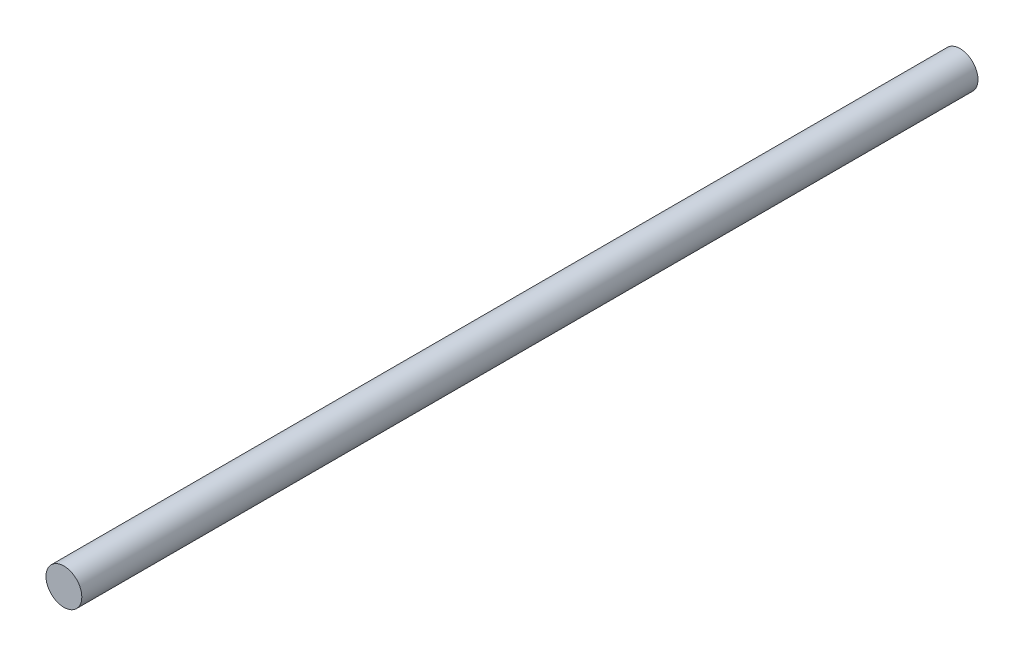
ISO-10303-21;
HEADER;
FILE_DESCRIPTION(('STEP AP214'),'2;1');
FILE_NAME('part.step','',(''),(''),'','','');
FILE_SCHEMA(('AUTOMOTIVE_DESIGN { 1 0 10303 214 1 1 1 1 }'));
ENDSEC;
DATA;
#1=APPLICATION_CONTEXT('core data for automotive mechanical design processes');
#2=APPLICATION_PROTOCOL_DEFINITION('international standard','automotive_design',2000,#1);
#3=PRODUCT_CONTEXT('',#1,'mechanical');
#4=PRODUCT('Part','Part','',(#3));
#5=PRODUCT_RELATED_PRODUCT_CATEGORY('part','',(#4));
#6=PRODUCT_DEFINITION_FORMATION('','',#4);
#7=PRODUCT_DEFINITION_CONTEXT('part definition',#1,'design');
#8=PRODUCT_DEFINITION('design','',#6,#7);
#9=PRODUCT_DEFINITION_SHAPE('','',#8);
#10=(LENGTH_UNIT() NAMED_UNIT(*) SI_UNIT(.MILLI.,.METRE.));
#11=(NAMED_UNIT(*) PLANE_ANGLE_UNIT() SI_UNIT($,.RADIAN.));
#12=(NAMED_UNIT(*) SI_UNIT($,.STERADIAN.) SOLID_ANGLE_UNIT());
#13=UNCERTAINTY_MEASURE_WITH_UNIT(LENGTH_MEASURE(1.E-05),#10,'distance_accuracy_value','');
#14=(GEOMETRIC_REPRESENTATION_CONTEXT(3) GLOBAL_UNCERTAINTY_ASSIGNED_CONTEXT((#13)) GLOBAL_UNIT_ASSIGNED_CONTEXT((#10,
#11,#12)) REPRESENTATION_CONTEXT('',''));
#15=CARTESIAN_POINT('',(0.,0.,0.));
#16=DIRECTION('',(0.,0.,1.));
#17=DIRECTION('',(1.,0.,0.));
#18=AXIS2_PLACEMENT_3D('',#15,#16,#17);
#19=CARTESIAN_POINT('',(0.,0.,500.));
#20=DIRECTION('',(0.,0.,-1.));
#21=DIRECTION('',(-1.,0.,0.));
#22=AXIS2_PLACEMENT_3D('',#19,#20,#21);
#23=CYLINDRICAL_SURFACE('',#22,10.);
#24=CARTESIAN_POINT('',(0.,0.,500.));
#25=DIRECTION('',(0.,0.,1.));
#26=DIRECTION('',(1.,0.,0.));
#27=AXIS2_PLACEMENT_3D('',#24,#25,#26);
#28=CIRCLE('',#27,10.);
#29=CARTESIAN_POINT('',(10.,0.,500.));
#30=VERTEX_POINT('',#29);
#31=EDGE_CURVE('E10',#30,#30,#28,.T.);
#32=ORIENTED_EDGE('',*,*,#31,.F.);
#33=EDGE_LOOP('',(#32));
#34=FACE_BOUND('',#33,.T.);
#35=CARTESIAN_POINT('',(0.,0.,0.));
#36=DIRECTION('',(0.,0.,1.));
#37=DIRECTION('',(1.,0.,0.));
#38=AXIS2_PLACEMENT_3D('',#35,#36,#37);
#39=CIRCLE('',#38,10.);
#40=CARTESIAN_POINT('',(10.,0.,0.));
#41=VERTEX_POINT('',#40);
#42=EDGE_CURVE('E36',#41,#41,#39,.T.);
#43=ORIENTED_EDGE('',*,*,#42,.T.);
#44=EDGE_LOOP('',(#43));
#45=FACE_BOUND('',#44,.T.);
#46=ADVANCED_FACE('F33',(#34,#45),#23,.T.);
#47=CARTESIAN_POINT('',(0.,0.,500.));
#48=DIRECTION('',(0.,0.,1.));
#49=DIRECTION('',(1.,0.,0.));
#50=AXIS2_PLACEMENT_3D('',#47,#48,#49);
#51=PLANE('',#50);
#52=ORIENTED_EDGE('',*,*,#31,.T.);
#53=EDGE_LOOP('',(#52));
#54=FACE_BOUND('',#53,.T.);
#55=ADVANCED_FACE('F48',(#54),#51,.T.);
#56=CARTESIAN_POINT('',(0.,0.,0.));
#57=DIRECTION('',(0.,0.,1.));
#58=DIRECTION('',(1.,0.,0.));
#59=AXIS2_PLACEMENT_3D('',#56,#57,#58);
#60=PLANE('',#59);
#61=ORIENTED_EDGE('',*,*,#42,.F.);
#62=EDGE_LOOP('',(#61));
#63=FACE_BOUND('',#62,.T.);
#64=ADVANCED_FACE('F46',(#63),#60,.F.);
#65=CLOSED_SHELL('',(#46,#55,#64));
#66=MANIFOLD_SOLID_BREP('B2',#65);
#67=ADVANCED_BREP_SHAPE_REPRESENTATION('',(#18,#66),#14);
#68=SHAPE_DEFINITION_REPRESENTATION(#9,#67);
ENDSEC;
END-ISO-10303-21;
